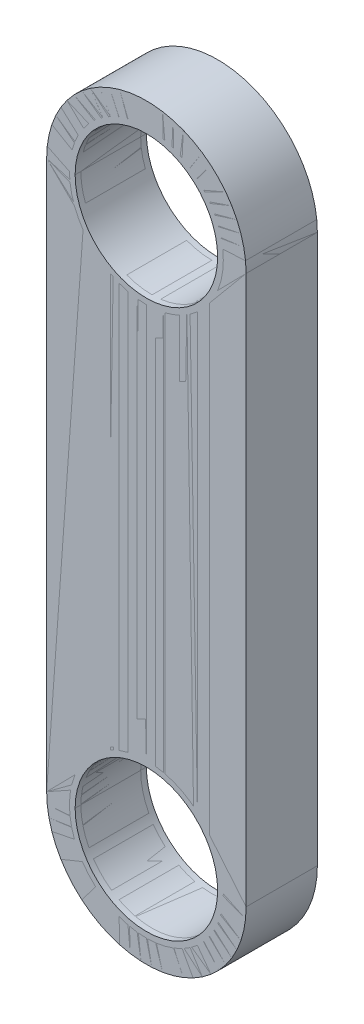
ISO-10303-21;
HEADER;
FILE_DESCRIPTION(('STEP AP214'),'2;1');
FILE_NAME('part.step','',(''),(''),'','','');
FILE_SCHEMA(('AUTOMOTIVE_DESIGN { 1 0 10303 214 1 1 1 1 }'));
ENDSEC;
DATA;
#1=APPLICATION_CONTEXT('core data for automotive mechanical design processes');
#2=APPLICATION_PROTOCOL_DEFINITION('international standard','automotive_design',2000,#1);
#3=PRODUCT_CONTEXT('',#1,'mechanical');
#4=PRODUCT('Part','Part','',(#3));
#5=PRODUCT_RELATED_PRODUCT_CATEGORY('part','',(#4));
#6=PRODUCT_DEFINITION_FORMATION('','',#4);
#7=PRODUCT_DEFINITION_CONTEXT('part definition',#1,'design');
#8=PRODUCT_DEFINITION('design','',#6,#7);
#9=PRODUCT_DEFINITION_SHAPE('','',#8);
#10=(LENGTH_UNIT() NAMED_UNIT(*) SI_UNIT(.MILLI.,.METRE.));
#11=(NAMED_UNIT(*) PLANE_ANGLE_UNIT() SI_UNIT($,.RADIAN.));
#12=(NAMED_UNIT(*) SI_UNIT($,.STERADIAN.) SOLID_ANGLE_UNIT());
#13=UNCERTAINTY_MEASURE_WITH_UNIT(LENGTH_MEASURE(1.E-05),#10,'distance_accuracy_value','');
#14=(GEOMETRIC_REPRESENTATION_CONTEXT(3) GLOBAL_UNCERTAINTY_ASSIGNED_CONTEXT((#13)) GLOBAL_UNIT_ASSIGNED_CONTEXT((#10,
#11,#12)) REPRESENTATION_CONTEXT('',''));
#15=CARTESIAN_POINT('',(0.,0.,0.));
#16=DIRECTION('',(0.,0.,1.));
#17=DIRECTION('',(1.,0.,0.));
#18=AXIS2_PLACEMENT_3D('',#15,#16,#17);
#19=CARTESIAN_POINT('',(0.,-9.625,2.5));
#20=DIRECTION('',(0.,0.,-1.));
#21=DIRECTION('',(-1.,0.,0.));
#22=AXIS2_PLACEMENT_3D('',#19,#20,#21);
#23=CYLINDRICAL_SURFACE('',#22,2.5);
#24=DIRECTION('',(0.,0.,-1.));
#25=VECTOR('',#24,1.);
#26=CARTESIAN_POINT('',(-2.5,-9.625,2.5));
#27=LINE('',#26,#25);
#28=CARTESIAN_POINT('',(-2.5,-9.625,2.3));
#29=VERTEX_POINT('',#28);
#30=CARTESIAN_POINT('',(-2.5,-9.625,0.200000000000001));
#31=VERTEX_POINT('',#30);
#32=EDGE_CURVE('P0_E189',#29,#31,#27,.T.);
#33=ORIENTED_EDGE('',*,*,#32,.T.);
#34=CARTESIAN_POINT('',(0.,-9.625,0.200000000000001));
#35=DIRECTION('',(0.,0.,1.));
#36=DIRECTION('',(1.,0.,0.));
#37=AXIS2_PLACEMENT_3D('',#34,#35,#36);
#38=CIRCLE('',#37,2.5);
#39=CARTESIAN_POINT('',(2.5,-9.625,0.200000000000001));
#40=VERTEX_POINT('',#39);
#41=EDGE_CURVE('P0_E227',#31,#40,#38,.F.);
#42=ORIENTED_EDGE('',*,*,#41,.T.);
#43=DIRECTION('',(0.,0.,-1.));
#44=VECTOR('',#43,1.);
#45=CARTESIAN_POINT('',(2.5,-9.625,2.5));
#46=LINE('',#45,#44);
#47=CARTESIAN_POINT('',(2.5,-9.625,2.3));
#48=VERTEX_POINT('',#47);
#49=EDGE_CURVE('P0_E192',#48,#40,#46,.T.);
#50=ORIENTED_EDGE('',*,*,#49,.F.);
#51=CARTESIAN_POINT('',(0.,-9.625,2.3));
#52=DIRECTION('',(0.,0.,1.));
#53=DIRECTION('',(1.,0.,0.));
#54=AXIS2_PLACEMENT_3D('',#51,#52,#53);
#55=CIRCLE('',#54,2.5);
#56=EDGE_CURVE('P0_E225',#48,#29,#55,.T.);
#57=ORIENTED_EDGE('',*,*,#56,.T.);
#58=EDGE_LOOP('',(#33,#42,#50,#57));
#59=FACE_BOUND('',#58,.T.);
#60=ADVANCED_FACE('P0_F40',(#59),#23,.F.);
#61=CARTESIAN_POINT('',(0.,9.625,2.5));
#62=DIRECTION('',(0.,0.,-1.));
#63=DIRECTION('',(-1.,0.,0.));
#64=AXIS2_PLACEMENT_3D('',#61,#62,#63);
#65=CYLINDRICAL_SURFACE('',#64,2.5);
#66=DIRECTION('',(0.,0.,-1.));
#67=VECTOR('',#66,1.);
#68=CARTESIAN_POINT('',(-2.5,9.625,2.5));
#69=LINE('',#68,#67);
#70=CARTESIAN_POINT('',(-2.5,9.625,2.3));
#71=VERTEX_POINT('',#70);
#72=CARTESIAN_POINT('',(-2.5,9.625,0.200000000000001));
#73=VERTEX_POINT('',#72);
#74=EDGE_CURVE('P0_E171',#71,#73,#69,.T.);
#75=ORIENTED_EDGE('',*,*,#74,.T.);
#76=CARTESIAN_POINT('',(0.,9.625,0.200000000000001));
#77=DIRECTION('',(0.,0.,1.));
#78=DIRECTION('',(1.,0.,0.));
#79=AXIS2_PLACEMENT_3D('',#76,#77,#78);
#80=CIRCLE('',#79,2.5);
#81=CARTESIAN_POINT('',(2.5,9.625,0.200000000000001));
#82=VERTEX_POINT('',#81);
#83=EDGE_CURVE('P0_E232',#73,#82,#80,.F.);
#84=ORIENTED_EDGE('',*,*,#83,.T.);
#85=DIRECTION('',(0.,0.,-1.));
#86=VECTOR('',#85,1.);
#87=CARTESIAN_POINT('',(2.5,9.625,2.5));
#88=LINE('',#87,#86);
#89=CARTESIAN_POINT('',(2.5,9.625,2.3));
#90=VERTEX_POINT('',#89);
#91=EDGE_CURVE('P0_E179',#90,#82,#88,.T.);
#92=ORIENTED_EDGE('',*,*,#91,.F.);
#93=CARTESIAN_POINT('',(0.,9.625,2.3));
#94=DIRECTION('',(0.,0.,1.));
#95=DIRECTION('',(1.,0.,0.));
#96=AXIS2_PLACEMENT_3D('',#93,#94,#95);
#97=CIRCLE('',#96,2.5);
#98=EDGE_CURVE('P0_E229',#90,#71,#97,.T.);
#99=ORIENTED_EDGE('',*,*,#98,.T.);
#100=EDGE_LOOP('',(#75,#84,#92,#99));
#101=FACE_BOUND('',#100,.T.);
#102=ADVANCED_FACE('P0_F280',(#101),#65,.F.);
#103=CARTESIAN_POINT('',(-3.5,-9.625,2.5));
#104=DIRECTION('',(1.,0.,0.));
#105=DIRECTION('',(0.,1.,0.));
#106=AXIS2_PLACEMENT_3D('',#103,#104,#105);
#107=PLANE('',#106);
#108=DIRECTION('',(0.,-1.,0.));
#109=VECTOR('',#108,1.);
#110=CARTESIAN_POINT('',(-3.5,-9.625,0.));
#111=LINE('',#110,#109);
#112=CARTESIAN_POINT('',(-3.5,9.625,0.));
#113=VERTEX_POINT('',#112);
#114=CARTESIAN_POINT('',(-3.5,-9.625,0.));
#115=VERTEX_POINT('',#114);
#116=EDGE_CURVE('P0_E148',#113,#115,#111,.T.);
#117=ORIENTED_EDGE('',*,*,#116,.T.);
#118=DIRECTION('',(0.,0.,-1.));
#119=VECTOR('',#118,1.);
#120=CARTESIAN_POINT('',(-3.5,-9.625,2.5));
#121=LINE('',#120,#119);
#122=CARTESIAN_POINT('',(-3.5,-9.625,2.5));
#123=VERTEX_POINT('',#122);
#124=EDGE_CURVE('P0_E142',#123,#115,#121,.T.);
#125=ORIENTED_EDGE('',*,*,#124,.F.);
#126=DIRECTION('',(0.,-1.,0.));
#127=VECTOR('',#126,1.);
#128=CARTESIAN_POINT('',(-3.5,-9.625,2.5));
#129=LINE('',#128,#127);
#130=CARTESIAN_POINT('',(-3.5,9.625,2.5));
#131=VERTEX_POINT('',#130);
#132=EDGE_CURVE('P0_E145',#131,#123,#129,.T.);
#133=ORIENTED_EDGE('',*,*,#132,.F.);
#134=DIRECTION('',(0.,0.,-1.));
#135=VECTOR('',#134,1.);
#136=CARTESIAN_POINT('',(-3.5,9.625,2.5));
#137=LINE('',#136,#135);
#138=EDGE_CURVE('P0_E185',#131,#113,#137,.T.);
#139=ORIENTED_EDGE('',*,*,#138,.T.);
#140=EDGE_LOOP('',(#117,#125,#133,#139));
#141=FACE_BOUND('',#140,.T.);
#142=ADVANCED_FACE('P0_F144',(#141),#107,.F.);
#143=CARTESIAN_POINT('',(0.,9.625,2.5));
#144=DIRECTION('',(0.,0.,-1.));
#145=DIRECTION('',(-1.,0.,0.));
#146=AXIS2_PLACEMENT_3D('',#143,#144,#145);
#147=CYLINDRICAL_SURFACE('',#146,3.5);
#148=CARTESIAN_POINT('',(0.,9.625,0.));
#149=DIRECTION('',(0.,0.,1.));
#150=DIRECTION('',(1.,0.,0.));
#151=AXIS2_PLACEMENT_3D('',#148,#149,#150);
#152=CIRCLE('',#151,3.5);
#153=CARTESIAN_POINT('',(3.5,9.625,0.));
#154=VERTEX_POINT('',#153);
#155=EDGE_CURVE('P0_E194',#154,#113,#152,.T.);
#156=ORIENTED_EDGE('',*,*,#155,.T.);
#157=ORIENTED_EDGE('',*,*,#138,.F.);
#158=CARTESIAN_POINT('',(0.,9.625,2.5));
#159=DIRECTION('',(0.,0.,1.));
#160=DIRECTION('',(1.,0.,0.));
#161=AXIS2_PLACEMENT_3D('',#158,#159,#160);
#162=CIRCLE('',#161,3.5);
#163=CARTESIAN_POINT('',(3.5,9.625,2.5));
#164=VERTEX_POINT('',#163);
#165=EDGE_CURVE('P0_E163',#164,#131,#162,.T.);
#166=ORIENTED_EDGE('',*,*,#165,.F.);
#167=DIRECTION('',(0.,0.,-1.));
#168=VECTOR('',#167,1.);
#169=CARTESIAN_POINT('',(3.5,9.625,2.5));
#170=LINE('',#169,#168);
#171=EDGE_CURVE('P0_E154',#164,#154,#170,.T.);
#172=ORIENTED_EDGE('',*,*,#171,.T.);
#173=EDGE_LOOP('',(#156,#157,#166,#172));
#174=FACE_BOUND('',#173,.T.);
#175=ADVANCED_FACE('P0_F420',(#174),#147,.T.);
#176=CARTESIAN_POINT('',(3.5,-9.625,2.5));
#177=DIRECTION('',(-1.,0.,0.));
#178=DIRECTION('',(0.,1.,0.));
#179=AXIS2_PLACEMENT_3D('',#176,#177,#178);
#180=PLANE('',#179);
#181=DIRECTION('',(0.,1.,0.));
#182=VECTOR('',#181,1.);
#183=CARTESIAN_POINT('',(3.5,-9.625,0.));
#184=LINE('',#183,#182);
#185=CARTESIAN_POINT('',(3.5,-9.625,0.));
#186=VERTEX_POINT('',#185);
#187=EDGE_CURVE('P0_E198',#186,#154,#184,.T.);
#188=ORIENTED_EDGE('',*,*,#187,.T.);
#189=ORIENTED_EDGE('',*,*,#171,.F.);
#190=DIRECTION('',(0.,1.,0.));
#191=VECTOR('',#190,1.);
#192=CARTESIAN_POINT('',(3.5,-9.625,2.5));
#193=LINE('',#192,#191);
#194=CARTESIAN_POINT('',(3.5,-9.625,2.5));
#195=VERTEX_POINT('',#194);
#196=EDGE_CURVE('P0_E170',#195,#164,#193,.T.);
#197=ORIENTED_EDGE('',*,*,#196,.F.);
#198=DIRECTION('',(0.,0.,-1.));
#199=VECTOR('',#198,1.);
#200=CARTESIAN_POINT('',(3.5,-9.625,2.5));
#201=LINE('',#200,#199);
#202=EDGE_CURVE('P0_E155',#195,#186,#201,.T.);
#203=ORIENTED_EDGE('',*,*,#202,.T.);
#204=EDGE_LOOP('',(#188,#189,#197,#203));
#205=FACE_BOUND('',#204,.T.);
#206=ADVANCED_FACE('P0_F411',(#205),#180,.F.);
#207=CARTESIAN_POINT('',(0.,-9.625,2.5));
#208=DIRECTION('',(0.,0.,-1.));
#209=DIRECTION('',(-1.,0.,0.));
#210=AXIS2_PLACEMENT_3D('',#207,#208,#209);
#211=CYLINDRICAL_SURFACE('',#210,3.5);
#212=CARTESIAN_POINT('',(0.,-9.625,0.));
#213=DIRECTION('',(0.,0.,1.));
#214=DIRECTION('',(1.,0.,0.));
#215=AXIS2_PLACEMENT_3D('',#212,#213,#214);
#216=CIRCLE('',#215,3.5);
#217=EDGE_CURVE('P0_E165',#115,#186,#216,.T.);
#218=ORIENTED_EDGE('',*,*,#217,.T.);
#219=ORIENTED_EDGE('',*,*,#202,.F.);
#220=CARTESIAN_POINT('',(0.,-9.625,2.5));
#221=DIRECTION('',(0.,0.,1.));
#222=DIRECTION('',(1.,0.,0.));
#223=AXIS2_PLACEMENT_3D('',#220,#221,#222);
#224=CIRCLE('',#223,3.5);
#225=EDGE_CURVE('P0_E161',#123,#195,#224,.T.);
#226=ORIENTED_EDGE('',*,*,#225,.F.);
#227=ORIENTED_EDGE('',*,*,#124,.T.);
#228=EDGE_LOOP('',(#218,#219,#226,#227));
#229=FACE_BOUND('',#228,.T.);
#230=ADVANCED_FACE('P0_F167',(#229),#211,.T.);
#231=CARTESIAN_POINT('',(0.,-9.625,0.));
#232=DIRECTION('',(0.,0.,1.));
#233=DIRECTION('',(1.,0.,0.));
#234=AXIS2_PLACEMENT_3D('',#231,#232,#233);
#235=PLANE('',#234);
#236=CARTESIAN_POINT('',(0.,-9.625,0.));
#237=DIRECTION('',(0.,0.,1.));
#238=DIRECTION('',(1.,0.,0.));
#239=AXIS2_PLACEMENT_3D('',#236,#237,#238);
#240=CIRCLE('',#239,2.7);
#241=CARTESIAN_POINT('',(2.7,-9.625,0.));
#242=VERTEX_POINT('',#241);
#243=CARTESIAN_POINT('',(-2.7,-9.625,0.));
#244=VERTEX_POINT('',#243);
#245=EDGE_CURVE('P0_E214',#242,#244,#240,.T.);
#246=ORIENTED_EDGE('',*,*,#245,.T.);
#247=CARTESIAN_POINT('',(0.,-9.625,0.));
#248=DIRECTION('',(0.,0.,1.));
#249=DIRECTION('',(1.,0.,0.));
#250=AXIS2_PLACEMENT_3D('',#247,#248,#249);
#251=CIRCLE('',#250,2.7);
#252=EDGE_CURVE('P0_E216',#244,#242,#251,.T.);
#253=ORIENTED_EDGE('',*,*,#252,.T.);
#254=EDGE_LOOP('',(#246,#253));
#255=FACE_BOUND('',#254,.T.);
#256=CARTESIAN_POINT('',(0.,9.625,0.));
#257=DIRECTION('',(0.,0.,1.));
#258=DIRECTION('',(1.,0.,0.));
#259=AXIS2_PLACEMENT_3D('',#256,#257,#258);
#260=CIRCLE('',#259,2.7);
#261=CARTESIAN_POINT('',(-2.7,9.625,0.));
#262=VERTEX_POINT('',#261);
#263=CARTESIAN_POINT('',(2.69999999999999,9.625,0.));
#264=VERTEX_POINT('',#263);
#265=EDGE_CURVE('P0_E188',#262,#264,#260,.T.);
#266=ORIENTED_EDGE('',*,*,#265,.T.);
#267=CARTESIAN_POINT('',(0.,9.625,0.));
#268=DIRECTION('',(0.,0.,1.));
#269=DIRECTION('',(1.,0.,0.));
#270=AXIS2_PLACEMENT_3D('',#267,#268,#269);
#271=CIRCLE('',#270,2.7);
#272=EDGE_CURVE('P0_E211',#264,#262,#271,.T.);
#273=ORIENTED_EDGE('',*,*,#272,.T.);
#274=EDGE_LOOP('',(#266,#273));
#275=FACE_BOUND('',#274,.T.);
#276=ORIENTED_EDGE('',*,*,#217,.F.);
#277=ORIENTED_EDGE('',*,*,#116,.F.);
#278=ORIENTED_EDGE('',*,*,#155,.F.);
#279=ORIENTED_EDGE('',*,*,#187,.F.);
#280=EDGE_LOOP('',(#276,#277,#278,#279));
#281=FACE_BOUND('',#280,.T.);
#282=ADVANCED_FACE('P0_F267',(#255,#275,#281),#235,.F.);
#283=CARTESIAN_POINT('',(0.,-9.625,2.5));
#284=DIRECTION('',(0.,0.,1.));
#285=DIRECTION('',(1.,0.,0.));
#286=AXIS2_PLACEMENT_3D('',#283,#284,#285);
#287=PLANE('',#286);
#288=CARTESIAN_POINT('',(0.,9.625,2.5));
#289=DIRECTION('',(0.,0.,1.));
#290=DIRECTION('',(1.,0.,0.));
#291=AXIS2_PLACEMENT_3D('',#288,#289,#290);
#292=CIRCLE('',#291,2.7);
#293=CARTESIAN_POINT('',(2.7,9.625,2.5));
#294=VERTEX_POINT('',#293);
#295=CARTESIAN_POINT('',(-2.70000000000001,9.625,2.5));
#296=VERTEX_POINT('',#295);
#297=EDGE_CURVE('P0_E50',#294,#296,#292,.F.);
#298=ORIENTED_EDGE('',*,*,#297,.T.);
#299=CARTESIAN_POINT('',(0.,9.625,2.5));
#300=DIRECTION('',(0.,0.,1.));
#301=DIRECTION('',(1.,0.,0.));
#302=AXIS2_PLACEMENT_3D('',#299,#300,#301);
#303=CIRCLE('',#302,2.7);
#304=EDGE_CURVE('P0_E11',#296,#294,#303,.F.);
#305=ORIENTED_EDGE('',*,*,#304,.T.);
#306=EDGE_LOOP('',(#298,#305));
#307=FACE_BOUND('',#306,.T.);
#308=CARTESIAN_POINT('',(0.,-9.625,2.5));
#309=DIRECTION('',(0.,0.,1.));
#310=DIRECTION('',(1.,0.,0.));
#311=AXIS2_PLACEMENT_3D('',#308,#309,#310);
#312=CIRCLE('',#311,2.7);
#313=CARTESIAN_POINT('',(-2.7,-9.625,2.5));
#314=VERTEX_POINT('',#313);
#315=CARTESIAN_POINT('',(2.7,-9.625,2.5));
#316=VERTEX_POINT('',#315);
#317=EDGE_CURVE('P0_E239',#314,#316,#312,.F.);
#318=ORIENTED_EDGE('',*,*,#317,.T.);
#319=CARTESIAN_POINT('',(0.,-9.625,2.5));
#320=DIRECTION('',(0.,0.,1.));
#321=DIRECTION('',(1.,0.,0.));
#322=AXIS2_PLACEMENT_3D('',#319,#320,#321);
#323=CIRCLE('',#322,2.7);
#324=EDGE_CURVE('P0_E241',#316,#314,#323,.F.);
#325=ORIENTED_EDGE('',*,*,#324,.T.);
#326=EDGE_LOOP('',(#318,#325));
#327=FACE_BOUND('',#326,.T.);
#328=ORIENTED_EDGE('',*,*,#225,.T.);
#329=ORIENTED_EDGE('',*,*,#196,.T.);
#330=ORIENTED_EDGE('',*,*,#165,.T.);
#331=ORIENTED_EDGE('',*,*,#132,.T.);
#332=EDGE_LOOP('',(#328,#329,#330,#331));
#333=FACE_BOUND('',#332,.T.);
#334=ADVANCED_FACE('P0_F159',(#307,#327,#333),#287,.T.);
#335=CARTESIAN_POINT('',(0.,9.625,2.5));
#336=DIRECTION('',(0.,0.,-1.));
#337=DIRECTION('',(-1.,0.,0.));
#338=AXIS2_PLACEMENT_3D('',#335,#336,#337);
#339=CYLINDRICAL_SURFACE('',#338,2.5);
#340=ORIENTED_EDGE('',*,*,#91,.T.);
#341=CARTESIAN_POINT('',(0.,9.625,0.200000000000001));
#342=DIRECTION('',(0.,0.,1.));
#343=DIRECTION('',(1.,0.,0.));
#344=AXIS2_PLACEMENT_3D('',#341,#342,#343);
#345=CIRCLE('',#344,2.5);
#346=EDGE_CURVE('P0_E237',#82,#73,#345,.F.);
#347=ORIENTED_EDGE('',*,*,#346,.T.);
#348=ORIENTED_EDGE('',*,*,#74,.F.);
#349=CARTESIAN_POINT('',(0.,9.625,2.3));
#350=DIRECTION('',(0.,0.,1.));
#351=DIRECTION('',(1.,0.,0.));
#352=AXIS2_PLACEMENT_3D('',#349,#350,#351);
#353=CIRCLE('',#352,2.5);
#354=EDGE_CURVE('P0_E235',#71,#90,#353,.T.);
#355=ORIENTED_EDGE('',*,*,#354,.T.);
#356=EDGE_LOOP('',(#340,#347,#348,#355));
#357=FACE_BOUND('',#356,.T.);
#358=ADVANCED_FACE('P0_F266',(#357),#339,.F.);
#359=CARTESIAN_POINT('',(0.,-9.625,2.5));
#360=DIRECTION('',(0.,0.,-1.));
#361=DIRECTION('',(-1.,0.,0.));
#362=AXIS2_PLACEMENT_3D('',#359,#360,#361);
#363=CYLINDRICAL_SURFACE('',#362,2.5);
#364=ORIENTED_EDGE('',*,*,#49,.T.);
#365=CARTESIAN_POINT('',(0.,-9.625,0.200000000000001));
#366=DIRECTION('',(0.,0.,1.));
#367=DIRECTION('',(1.,0.,0.));
#368=AXIS2_PLACEMENT_3D('',#365,#366,#367);
#369=CIRCLE('',#368,2.5);
#370=EDGE_CURVE('P0_E222',#40,#31,#369,.F.);
#371=ORIENTED_EDGE('',*,*,#370,.T.);
#372=ORIENTED_EDGE('',*,*,#32,.F.);
#373=CARTESIAN_POINT('',(0.,-9.625,2.3));
#374=DIRECTION('',(0.,0.,1.));
#375=DIRECTION('',(1.,0.,0.));
#376=AXIS2_PLACEMENT_3D('',#373,#374,#375);
#377=CIRCLE('',#376,2.5);
#378=EDGE_CURVE('P0_E219',#29,#48,#377,.T.);
#379=ORIENTED_EDGE('',*,*,#378,.T.);
#380=EDGE_LOOP('',(#364,#371,#372,#379));
#381=FACE_BOUND('',#380,.T.);
#382=ADVANCED_FACE('P0_F273',(#381),#363,.F.);
#383=CARTESIAN_POINT('',(0.,-9.625,0.));
#384=DIRECTION('',(0.,0.,-1.));
#385=DIRECTION('',(-1.,0.,0.));
#386=AXIS2_PLACEMENT_3D('',#383,#384,#385);
#387=CONICAL_SURFACE('',#386,2.7,0.785398163397438);
#388=DIRECTION('',(0.70710678118654,0.,-0.707106781186555));
#389=VECTOR('',#388,1.);
#390=CARTESIAN_POINT('',(2.5,-9.625,0.200000000000001));
#391=LINE('',#390,#389);
#392=EDGE_CURVE('P0_E245',#40,#242,#391,.T.);
#393=ORIENTED_EDGE('',*,*,#392,.F.);
#394=ORIENTED_EDGE('',*,*,#41,.F.);
#395=DIRECTION('',(0.70710678118654,0.,0.707106781186555));
#396=VECTOR('',#395,1.);
#397=CARTESIAN_POINT('',(-2.7,-9.625,0.));
#398=LINE('',#397,#396);
#399=EDGE_CURVE('P0_E204',#244,#31,#398,.T.);
#400=ORIENTED_EDGE('',*,*,#399,.F.);
#401=ORIENTED_EDGE('',*,*,#245,.F.);
#402=EDGE_LOOP('',(#393,#394,#400,#401));
#403=FACE_BOUND('',#402,.T.);
#404=ADVANCED_FACE('P0_F290',(#403),#387,.F.);
#405=CARTESIAN_POINT('',(0.,-9.625,0.));
#406=DIRECTION('',(0.,0.,-1.));
#407=DIRECTION('',(-1.,0.,0.));
#408=AXIS2_PLACEMENT_3D('',#405,#406,#407);
#409=CONICAL_SURFACE('',#408,2.7,0.785398163397438);
#410=ORIENTED_EDGE('',*,*,#399,.T.);
#411=ORIENTED_EDGE('',*,*,#370,.F.);
#412=ORIENTED_EDGE('',*,*,#392,.T.);
#413=ORIENTED_EDGE('',*,*,#252,.F.);
#414=EDGE_LOOP('',(#410,#411,#412,#413));
#415=FACE_BOUND('',#414,.T.);
#416=ADVANCED_FACE('P0_F294',(#415),#409,.F.);
#417=CARTESIAN_POINT('',(0.,9.625,0.));
#418=DIRECTION('',(0.,0.,-1.));
#419=DIRECTION('',(-1.,0.,0.));
#420=AXIS2_PLACEMENT_3D('',#417,#418,#419);
#421=CONICAL_SURFACE('',#420,2.7,0.785398163397438);
#422=DIRECTION('',(-0.70710678118654,0.,-0.707106781186555));
#423=VECTOR('',#422,1.);
#424=CARTESIAN_POINT('',(-2.5,9.625,0.200000000000001));
#425=LINE('',#424,#423);
#426=EDGE_CURVE('P0_E249',#73,#262,#425,.T.);
#427=ORIENTED_EDGE('',*,*,#426,.F.);
#428=ORIENTED_EDGE('',*,*,#346,.F.);
#429=DIRECTION('',(-0.70710678118654,0.,0.707106781186555));
#430=VECTOR('',#429,1.);
#431=CARTESIAN_POINT('',(2.69999999999999,9.625,0.));
#432=LINE('',#431,#430);
#433=EDGE_CURVE('P0_E247',#264,#82,#432,.T.);
#434=ORIENTED_EDGE('',*,*,#433,.F.);
#435=ORIENTED_EDGE('',*,*,#265,.F.);
#436=EDGE_LOOP('',(#427,#428,#434,#435));
#437=FACE_BOUND('',#436,.T.);
#438=ADVANCED_FACE('P0_F301',(#437),#421,.F.);
#439=CARTESIAN_POINT('',(0.,9.625,0.));
#440=DIRECTION('',(0.,0.,-1.));
#441=DIRECTION('',(-1.,0.,0.));
#442=AXIS2_PLACEMENT_3D('',#439,#440,#441);
#443=CONICAL_SURFACE('',#442,2.7,0.785398163397438);
#444=ORIENTED_EDGE('',*,*,#433,.T.);
#445=ORIENTED_EDGE('',*,*,#83,.F.);
#446=ORIENTED_EDGE('',*,*,#426,.T.);
#447=ORIENTED_EDGE('',*,*,#272,.F.);
#448=EDGE_LOOP('',(#444,#445,#446,#447));
#449=FACE_BOUND('',#448,.T.);
#450=ADVANCED_FACE('P0_F309',(#449),#443,.F.);
#451=CARTESIAN_POINT('',(0.,9.625,2.3));
#452=DIRECTION('',(0.,0.,1.));
#453=DIRECTION('',(1.,0.,0.));
#454=AXIS2_PLACEMENT_3D('',#451,#452,#453);
#455=CONICAL_SURFACE('',#454,2.5,0.785398163397457);
#456=DIRECTION('',(0.707106781186554,0.,-0.707106781186541));
#457=VECTOR('',#456,1.);
#458=CARTESIAN_POINT('',(-2.70000000000001,9.625,2.5));
#459=LINE('',#458,#457);
#460=EDGE_CURVE('P0_E252',#296,#71,#459,.T.);
#461=ORIENTED_EDGE('',*,*,#460,.F.);
#462=ORIENTED_EDGE('',*,*,#297,.F.);
#463=DIRECTION('',(0.707106781186554,0.,0.707106781186541));
#464=VECTOR('',#463,1.);
#465=CARTESIAN_POINT('',(2.5,9.625,2.3));
#466=LINE('',#465,#464);
#467=EDGE_CURVE('P0_E62',#90,#294,#466,.T.);
#468=ORIENTED_EDGE('',*,*,#467,.F.);
#469=ORIENTED_EDGE('',*,*,#354,.F.);
#470=EDGE_LOOP('',(#461,#462,#468,#469));
#471=FACE_BOUND('',#470,.T.);
#472=ADVANCED_FACE('P0_F315',(#471),#455,.F.);
#473=CARTESIAN_POINT('',(0.,9.625,2.3));
#474=DIRECTION('',(0.,0.,1.));
#475=DIRECTION('',(1.,0.,0.));
#476=AXIS2_PLACEMENT_3D('',#473,#474,#475);
#477=CONICAL_SURFACE('',#476,2.5,0.785398163397457);
#478=ORIENTED_EDGE('',*,*,#467,.T.);
#479=ORIENTED_EDGE('',*,*,#304,.F.);
#480=ORIENTED_EDGE('',*,*,#460,.T.);
#481=ORIENTED_EDGE('',*,*,#98,.F.);
#482=EDGE_LOOP('',(#478,#479,#480,#481));
#483=FACE_BOUND('',#482,.T.);
#484=ADVANCED_FACE('P0_F323',(#483),#477,.F.);
#485=CARTESIAN_POINT('',(0.,-9.625,2.3));
#486=DIRECTION('',(0.,0.,1.));
#487=DIRECTION('',(1.,0.,0.));
#488=AXIS2_PLACEMENT_3D('',#485,#486,#487);
#489=CONICAL_SURFACE('',#488,2.5,0.785398163397457);
#490=DIRECTION('',(-0.707106781186554,0.,-0.707106781186541));
#491=VECTOR('',#490,1.);
#492=CARTESIAN_POINT('',(2.7,-9.625,2.5));
#493=LINE('',#492,#491);
#494=EDGE_CURVE('P0_E254',#316,#48,#493,.T.);
#495=ORIENTED_EDGE('',*,*,#494,.F.);
#496=ORIENTED_EDGE('',*,*,#317,.F.);
#497=DIRECTION('',(-0.707106781186554,0.,0.707106781186541));
#498=VECTOR('',#497,1.);
#499=CARTESIAN_POINT('',(-2.5,-9.625,2.3));
#500=LINE('',#499,#498);
#501=EDGE_CURVE('P0_E45',#29,#314,#500,.T.);
#502=ORIENTED_EDGE('',*,*,#501,.F.);
#503=ORIENTED_EDGE('',*,*,#56,.F.);
#504=EDGE_LOOP('',(#495,#496,#502,#503));
#505=FACE_BOUND('',#504,.T.);
#506=ADVANCED_FACE('P0_F43',(#505),#489,.F.);
#507=CARTESIAN_POINT('',(0.,-9.625,2.3));
#508=DIRECTION('',(0.,0.,1.));
#509=DIRECTION('',(1.,0.,0.));
#510=AXIS2_PLACEMENT_3D('',#507,#508,#509);
#511=CONICAL_SURFACE('',#510,2.5,0.785398163397457);
#512=ORIENTED_EDGE('',*,*,#501,.T.);
#513=ORIENTED_EDGE('',*,*,#324,.F.);
#514=ORIENTED_EDGE('',*,*,#494,.T.);
#515=ORIENTED_EDGE('',*,*,#378,.F.);
#516=EDGE_LOOP('',(#512,#513,#514,#515));
#517=FACE_BOUND('',#516,.T.);
#518=ADVANCED_FACE('P0_F262',(#517),#511,.F.);
#519=CLOSED_SHELL('',(#60,#102,#142,#175,#206,#230,#282,#334,#358,#382,#404,#416,#438,#450,#472,
#484,#506,#518));
#520=MANIFOLD_SOLID_BREP('P0_B2',#519);
#521=CARTESIAN_POINT('',(0.,-9.625,2.5));
#522=DIRECTION('',(0.,0.,-1.));
#523=DIRECTION('',(-1.,0.,0.));
#524=AXIS2_PLACEMENT_3D('',#521,#522,#523);
#525=CYLINDRICAL_SURFACE('',#524,2.5);
#526=DIRECTION('',(0.,0.,-1.));
#527=VECTOR('',#526,1.);
#528=CARTESIAN_POINT('',(2.5,-9.625,2.5));
#529=LINE('',#528,#527);
#530=CARTESIAN_POINT('',(2.5,-9.625,2.5));
#531=VERTEX_POINT('',#530);
#532=CARTESIAN_POINT('',(2.5,-9.625,0.));
#533=VERTEX_POINT('',#532);
#534=EDGE_CURVE('P1_E162',#531,#533,#529,.T.);
#535=ORIENTED_EDGE('',*,*,#534,.F.);
#536=CARTESIAN_POINT('',(0.,-9.625,2.5));
#537=DIRECTION('',(0.,0.,1.));
#538=DIRECTION('',(1.,0.,0.));
#539=AXIS2_PLACEMENT_3D('',#536,#537,#538);
#540=CIRCLE('',#539,2.5);
#541=CARTESIAN_POINT('',(-2.5,-9.625,2.5));
#542=VERTEX_POINT('',#541);
#543=EDGE_CURVE('P1_E149',#531,#542,#540,.T.);
#544=ORIENTED_EDGE('',*,*,#543,.T.);
#545=DIRECTION('',(0.,0.,-1.));
#546=VECTOR('',#545,1.);
#547=CARTESIAN_POINT('',(-2.5,-9.625,2.5));
#548=LINE('',#547,#546);
#549=CARTESIAN_POINT('',(-2.5,-9.625,0.));
#550=VERTEX_POINT('',#549);
#551=EDGE_CURVE('P1_E141',#542,#550,#548,.T.);
#552=ORIENTED_EDGE('',*,*,#551,.T.);
#553=CARTESIAN_POINT('',(0.,-9.625,0.));
#554=DIRECTION('',(0.,0.,1.));
#555=DIRECTION('',(1.,0.,0.));
#556=AXIS2_PLACEMENT_3D('',#553,#554,#555);
#557=CIRCLE('',#556,2.5);
#558=EDGE_CURVE('P1_E128',#533,#550,#557,.T.);
#559=ORIENTED_EDGE('',*,*,#558,.F.);
#560=EDGE_LOOP('',(#535,#544,#552,#559));
#561=FACE_BOUND('',#560,.T.);
#562=ADVANCED_FACE('P1_F17',(#561),#525,.F.);
#563=CARTESIAN_POINT('',(0.,9.625,2.5));
#564=DIRECTION('',(0.,0.,-1.));
#565=DIRECTION('',(-1.,0.,0.));
#566=AXIS2_PLACEMENT_3D('',#563,#564,#565);
#567=CYLINDRICAL_SURFACE('',#566,2.5);
#568=DIRECTION('',(0.,0.,-1.));
#569=VECTOR('',#568,1.);
#570=CARTESIAN_POINT('',(2.5,9.625,2.5));
#571=LINE('',#570,#569);
#572=CARTESIAN_POINT('',(2.5,9.625,2.5));
#573=VERTEX_POINT('',#572);
#574=CARTESIAN_POINT('',(2.5,9.625,0.));
#575=VERTEX_POINT('',#574);
#576=EDGE_CURVE('P1_E133',#573,#575,#571,.T.);
#577=ORIENTED_EDGE('',*,*,#576,.F.);
#578=CARTESIAN_POINT('',(0.,9.625,2.5));
#579=DIRECTION('',(0.,0.,1.));
#580=DIRECTION('',(1.,0.,0.));
#581=AXIS2_PLACEMENT_3D('',#578,#579,#580);
#582=CIRCLE('',#581,2.5);
#583=CARTESIAN_POINT('',(-2.5,9.625,2.5));
#584=VERTEX_POINT('',#583);
#585=EDGE_CURVE('P1_E148',#573,#584,#582,.T.);
#586=ORIENTED_EDGE('',*,*,#585,.T.);
#587=DIRECTION('',(0.,0.,-1.));
#588=VECTOR('',#587,1.);
#589=CARTESIAN_POINT('',(-2.5,9.625,2.5));
#590=LINE('',#589,#588);
#591=CARTESIAN_POINT('',(-2.5,9.625,0.));
#592=VERTEX_POINT('',#591);
#593=EDGE_CURVE('P1_E122',#584,#592,#590,.T.);
#594=ORIENTED_EDGE('',*,*,#593,.T.);
#595=CARTESIAN_POINT('',(0.,9.625,0.));
#596=DIRECTION('',(0.,0.,1.));
#597=DIRECTION('',(1.,0.,0.));
#598=AXIS2_PLACEMENT_3D('',#595,#596,#597);
#599=CIRCLE('',#598,2.5);
#600=EDGE_CURVE('P1_E126',#575,#592,#599,.T.);
#601=ORIENTED_EDGE('',*,*,#600,.F.);
#602=EDGE_LOOP('',(#577,#586,#594,#601));
#603=FACE_BOUND('',#602,.T.);
#604=ADVANCED_FACE('P1_F178',(#603),#567,.F.);
#605=CARTESIAN_POINT('',(-3.5,-9.625,2.5));
#606=DIRECTION('',(1.,0.,0.));
#607=DIRECTION('',(0.,1.,0.));
#608=AXIS2_PLACEMENT_3D('',#605,#606,#607);
#609=PLANE('',#608);
#610=DIRECTION('',(0.,-1.,0.));
#611=VECTOR('',#610,1.);
#612=CARTESIAN_POINT('',(-3.5,-9.625,0.));
#613=LINE('',#612,#611);
#614=CARTESIAN_POINT('',(-3.5,9.625,0.));
#615=VERTEX_POINT('',#614);
#616=CARTESIAN_POINT('',(-3.5,-9.625,0.));
#617=VERTEX_POINT('',#616);
#618=EDGE_CURVE('P1_E156',#615,#617,#613,.T.);
#619=ORIENTED_EDGE('',*,*,#618,.T.);
#620=DIRECTION('',(0.,0.,-1.));
#621=VECTOR('',#620,1.);
#622=CARTESIAN_POINT('',(-3.5,-9.625,2.5));
#623=LINE('',#622,#621);
#624=CARTESIAN_POINT('',(-3.5,-9.625,2.5));
#625=VERTEX_POINT('',#624);
#626=EDGE_CURVE('P1_E102',#625,#617,#623,.T.);
#627=ORIENTED_EDGE('',*,*,#626,.F.);
#628=DIRECTION('',(0.,-1.,0.));
#629=VECTOR('',#628,1.);
#630=CARTESIAN_POINT('',(-3.5,-9.625,2.5));
#631=LINE('',#630,#629);
#632=CARTESIAN_POINT('',(-3.5,9.625,2.5));
#633=VERTEX_POINT('',#632);
#634=EDGE_CURVE('P1_E111',#633,#625,#631,.T.);
#635=ORIENTED_EDGE('',*,*,#634,.F.);
#636=DIRECTION('',(0.,0.,-1.));
#637=VECTOR('',#636,1.);
#638=CARTESIAN_POINT('',(-3.5,9.625,2.5));
#639=LINE('',#638,#637);
#640=EDGE_CURVE('P1_E11',#633,#615,#639,.T.);
#641=ORIENTED_EDGE('',*,*,#640,.T.);
#642=EDGE_LOOP('',(#619,#627,#635,#641));
#643=FACE_BOUND('',#642,.T.);
#644=ADVANCED_FACE('P1_F290',(#643),#609,.F.);
#645=CARTESIAN_POINT('',(0.,9.625,2.5));
#646=DIRECTION('',(0.,0.,-1.));
#647=DIRECTION('',(-1.,0.,0.));
#648=AXIS2_PLACEMENT_3D('',#645,#646,#647);
#649=CYLINDRICAL_SURFACE('',#648,3.5);
#650=CARTESIAN_POINT('',(0.,9.625,0.));
#651=DIRECTION('',(0.,0.,1.));
#652=DIRECTION('',(1.,0.,0.));
#653=AXIS2_PLACEMENT_3D('',#650,#651,#652);
#654=CIRCLE('',#653,3.5);
#655=CARTESIAN_POINT('',(3.5,9.625,0.));
#656=VERTEX_POINT('',#655);
#657=EDGE_CURVE('P1_E153',#656,#615,#654,.T.);
#658=ORIENTED_EDGE('',*,*,#657,.T.);
#659=ORIENTED_EDGE('',*,*,#640,.F.);
#660=CARTESIAN_POINT('',(0.,9.625,2.5));
#661=DIRECTION('',(0.,0.,1.));
#662=DIRECTION('',(1.,0.,0.));
#663=AXIS2_PLACEMENT_3D('',#660,#661,#662);
#664=CIRCLE('',#663,3.5);
#665=CARTESIAN_POINT('',(3.5,9.625,2.5));
#666=VERTEX_POINT('',#665);
#667=EDGE_CURVE('P1_E105',#666,#633,#664,.T.);
#668=ORIENTED_EDGE('',*,*,#667,.F.);
#669=DIRECTION('',(0.,0.,-1.));
#670=VECTOR('',#669,1.);
#671=CARTESIAN_POINT('',(3.5,9.625,2.5));
#672=LINE('',#671,#670);
#673=EDGE_CURVE('P1_E28',#666,#656,#672,.T.);
#674=ORIENTED_EDGE('',*,*,#673,.T.);
#675=EDGE_LOOP('',(#658,#659,#668,#674));
#676=FACE_BOUND('',#675,.T.);
#677=ADVANCED_FACE('P1_F106',(#676),#649,.T.);
#678=CARTESIAN_POINT('',(3.5,-9.625,2.5));
#679=DIRECTION('',(-1.,0.,0.));
#680=DIRECTION('',(0.,1.,0.));
#681=AXIS2_PLACEMENT_3D('',#678,#679,#680);
#682=PLANE('',#681);
#683=DIRECTION('',(0.,1.,0.));
#684=VECTOR('',#683,1.);
#685=CARTESIAN_POINT('',(3.5,-9.625,0.));
#686=LINE('',#685,#684);
#687=CARTESIAN_POINT('',(3.5,-9.625,0.));
#688=VERTEX_POINT('',#687);
#689=EDGE_CURVE('P1_E99',#688,#656,#686,.T.);
#690=ORIENTED_EDGE('',*,*,#689,.T.);
#691=ORIENTED_EDGE('',*,*,#673,.F.);
#692=DIRECTION('',(0.,1.,0.));
#693=VECTOR('',#692,1.);
#694=CARTESIAN_POINT('',(3.5,-9.625,2.5));
#695=LINE('',#694,#693);
#696=CARTESIAN_POINT('',(3.5,-9.625,2.5));
#697=VERTEX_POINT('',#696);
#698=EDGE_CURVE('P1_E96',#697,#666,#695,.T.);
#699=ORIENTED_EDGE('',*,*,#698,.F.);
#700=DIRECTION('',(0.,0.,-1.));
#701=VECTOR('',#700,1.);
#702=CARTESIAN_POINT('',(3.5,-9.625,2.5));
#703=LINE('',#702,#701);
#704=EDGE_CURVE('P1_E135',#697,#688,#703,.T.);
#705=ORIENTED_EDGE('',*,*,#704,.T.);
#706=EDGE_LOOP('',(#690,#691,#699,#705));
#707=FACE_BOUND('',#706,.T.);
#708=ADVANCED_FACE('P1_F94',(#707),#682,.F.);
#709=CARTESIAN_POINT('',(0.,-9.625,2.5));
#710=DIRECTION('',(0.,0.,-1.));
#711=DIRECTION('',(-1.,0.,0.));
#712=AXIS2_PLACEMENT_3D('',#709,#710,#711);
#713=CYLINDRICAL_SURFACE('',#712,3.5);
#714=CARTESIAN_POINT('',(0.,-9.625,0.));
#715=DIRECTION('',(0.,0.,1.));
#716=DIRECTION('',(1.,0.,0.));
#717=AXIS2_PLACEMENT_3D('',#714,#715,#716);
#718=CIRCLE('',#717,3.5);
#719=EDGE_CURVE('P1_E21',#617,#688,#718,.T.);
#720=ORIENTED_EDGE('',*,*,#719,.T.);
#721=ORIENTED_EDGE('',*,*,#704,.F.);
#722=CARTESIAN_POINT('',(0.,-9.625,2.5));
#723=DIRECTION('',(0.,0.,1.));
#724=DIRECTION('',(1.,0.,0.));
#725=AXIS2_PLACEMENT_3D('',#722,#723,#724);
#726=CIRCLE('',#725,3.5);
#727=EDGE_CURVE('P1_E115',#625,#697,#726,.T.);
#728=ORIENTED_EDGE('',*,*,#727,.F.);
#729=ORIENTED_EDGE('',*,*,#626,.T.);
#730=EDGE_LOOP('',(#720,#721,#728,#729));
#731=FACE_BOUND('',#730,.T.);
#732=ADVANCED_FACE('P1_F182',(#731),#713,.T.);
#733=CARTESIAN_POINT('',(0.,-9.625,0.));
#734=DIRECTION('',(0.,0.,1.));
#735=DIRECTION('',(1.,0.,0.));
#736=AXIS2_PLACEMENT_3D('',#733,#734,#735);
#737=PLANE('',#736);
#738=CARTESIAN_POINT('',(0.,-9.625,0.));
#739=DIRECTION('',(0.,0.,1.));
#740=DIRECTION('',(1.,0.,0.));
#741=AXIS2_PLACEMENT_3D('',#738,#739,#740);
#742=CIRCLE('',#741,2.5);
#743=EDGE_CURVE('P1_E145',#550,#533,#742,.T.);
#744=ORIENTED_EDGE('',*,*,#743,.T.);
#745=ORIENTED_EDGE('',*,*,#558,.T.);
#746=EDGE_LOOP('',(#744,#745));
#747=FACE_BOUND('',#746,.T.);
#748=CARTESIAN_POINT('',(0.,9.625,0.));
#749=DIRECTION('',(0.,0.,1.));
#750=DIRECTION('',(1.,0.,0.));
#751=AXIS2_PLACEMENT_3D('',#748,#749,#750);
#752=CIRCLE('',#751,2.5);
#753=EDGE_CURVE('P1_E129',#592,#575,#752,.T.);
#754=ORIENTED_EDGE('',*,*,#753,.T.);
#755=ORIENTED_EDGE('',*,*,#600,.T.);
#756=EDGE_LOOP('',(#754,#755));
#757=FACE_BOUND('',#756,.T.);
#758=ORIENTED_EDGE('',*,*,#719,.F.);
#759=ORIENTED_EDGE('',*,*,#618,.F.);
#760=ORIENTED_EDGE('',*,*,#657,.F.);
#761=ORIENTED_EDGE('',*,*,#689,.F.);
#762=EDGE_LOOP('',(#758,#759,#760,#761));
#763=FACE_BOUND('',#762,.T.);
#764=ADVANCED_FACE('P1_F19',(#747,#757,#763),#737,.F.);
#765=CARTESIAN_POINT('',(0.,-9.625,2.5));
#766=DIRECTION('',(0.,0.,1.));
#767=DIRECTION('',(1.,0.,0.));
#768=AXIS2_PLACEMENT_3D('',#765,#766,#767);
#769=PLANE('',#768);
#770=CARTESIAN_POINT('',(0.,-9.625,2.5));
#771=DIRECTION('',(0.,0.,1.));
#772=DIRECTION('',(1.,0.,0.));
#773=AXIS2_PLACEMENT_3D('',#770,#771,#772);
#774=CIRCLE('',#773,2.5);
#775=EDGE_CURVE('P1_E165',#542,#531,#774,.T.);
#776=ORIENTED_EDGE('',*,*,#775,.F.);
#777=ORIENTED_EDGE('',*,*,#543,.F.);
#778=EDGE_LOOP('',(#776,#777));
#779=FACE_BOUND('',#778,.T.);
#780=CARTESIAN_POINT('',(0.,9.625,2.5));
#781=DIRECTION('',(0.,0.,1.));
#782=DIRECTION('',(1.,0.,0.));
#783=AXIS2_PLACEMENT_3D('',#780,#781,#782);
#784=CIRCLE('',#783,2.5);
#785=EDGE_CURVE('P1_E137',#584,#573,#784,.T.);
#786=ORIENTED_EDGE('',*,*,#785,.F.);
#787=ORIENTED_EDGE('',*,*,#585,.F.);
#788=EDGE_LOOP('',(#786,#787));
#789=FACE_BOUND('',#788,.T.);
#790=ORIENTED_EDGE('',*,*,#727,.T.);
#791=ORIENTED_EDGE('',*,*,#698,.T.);
#792=ORIENTED_EDGE('',*,*,#667,.T.);
#793=ORIENTED_EDGE('',*,*,#634,.T.);
#794=EDGE_LOOP('',(#790,#791,#792,#793));
#795=FACE_BOUND('',#794,.T.);
#796=ADVANCED_FACE('P1_F113',(#779,#789,#795),#769,.T.);
#797=CARTESIAN_POINT('',(0.,9.625,2.5));
#798=DIRECTION('',(0.,0.,-1.));
#799=DIRECTION('',(-1.,0.,0.));
#800=AXIS2_PLACEMENT_3D('',#797,#798,#799);
#801=CYLINDRICAL_SURFACE('',#800,2.5);
#802=ORIENTED_EDGE('',*,*,#785,.T.);
#803=ORIENTED_EDGE('',*,*,#576,.T.);
#804=ORIENTED_EDGE('',*,*,#753,.F.);
#805=ORIENTED_EDGE('',*,*,#593,.F.);
#806=EDGE_LOOP('',(#802,#803,#804,#805));
#807=FACE_BOUND('',#806,.T.);
#808=ADVANCED_FACE('P1_F174',(#807),#801,.F.);
#809=CARTESIAN_POINT('',(0.,-9.625,2.5));
#810=DIRECTION('',(0.,0.,-1.));
#811=DIRECTION('',(-1.,0.,0.));
#812=AXIS2_PLACEMENT_3D('',#809,#810,#811);
#813=CYLINDRICAL_SURFACE('',#812,2.5);
#814=ORIENTED_EDGE('',*,*,#775,.T.);
#815=ORIENTED_EDGE('',*,*,#534,.T.);
#816=ORIENTED_EDGE('',*,*,#743,.F.);
#817=ORIENTED_EDGE('',*,*,#551,.F.);
#818=EDGE_LOOP('',(#814,#815,#816,#817));
#819=FACE_BOUND('',#818,.T.);
#820=ADVANCED_FACE('P1_F212',(#819),#813,.F.);
#821=CLOSED_SHELL('',(#562,#604,#644,#677,#708,#732,#764,#796,#808,#820));
#822=MANIFOLD_SOLID_BREP('P1_B1',#821);
#823=ADVANCED_BREP_SHAPE_REPRESENTATION('',(#18,#520,#822),#14);
#824=SHAPE_DEFINITION_REPRESENTATION(#9,#823);
ENDSEC;
END-ISO-10303-21;
